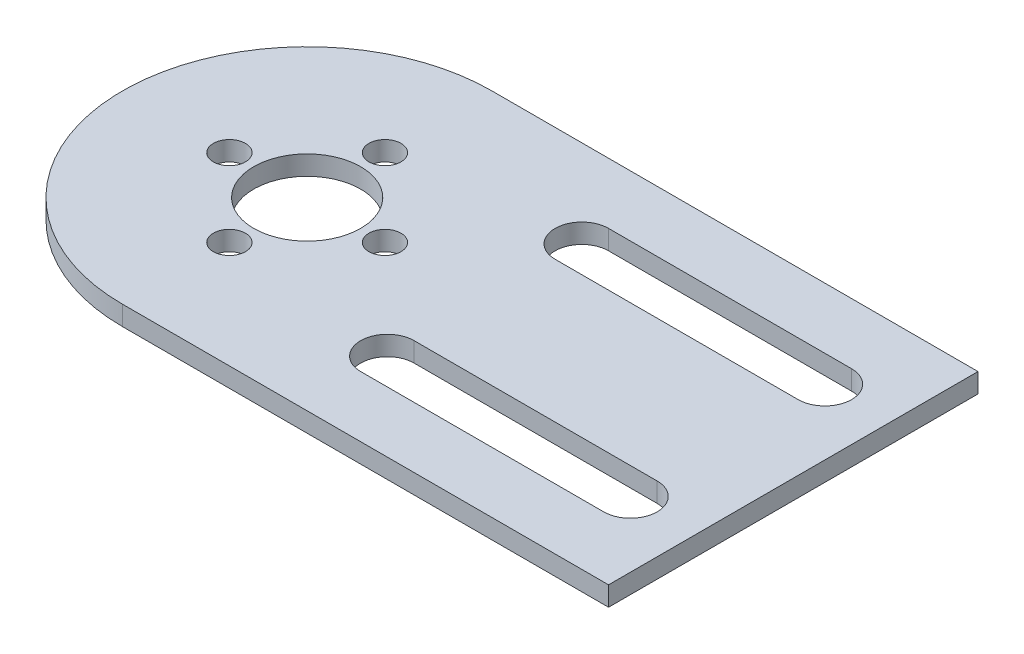
ISO-10303-21;
HEADER;
FILE_DESCRIPTION(('STEP AP214'),'2;1');
FILE_NAME('part.step','',(''),(''),'','','');
FILE_SCHEMA(('AUTOMOTIVE_DESIGN { 1 0 10303 214 1 1 1 1 }'));
ENDSEC;
DATA;
#1=APPLICATION_CONTEXT('core data for automotive mechanical design processes');
#2=APPLICATION_PROTOCOL_DEFINITION('international standard','automotive_design',2000,#1);
#3=PRODUCT_CONTEXT('',#1,'mechanical');
#4=PRODUCT('Part','Part','',(#3));
#5=PRODUCT_RELATED_PRODUCT_CATEGORY('part','',(#4));
#6=PRODUCT_DEFINITION_FORMATION('','',#4);
#7=PRODUCT_DEFINITION_CONTEXT('part definition',#1,'design');
#8=PRODUCT_DEFINITION('design','',#6,#7);
#9=PRODUCT_DEFINITION_SHAPE('','',#8);
#10=(LENGTH_UNIT() NAMED_UNIT(*) SI_UNIT(.MILLI.,.METRE.));
#11=(NAMED_UNIT(*) PLANE_ANGLE_UNIT() SI_UNIT($,.RADIAN.));
#12=(NAMED_UNIT(*) SI_UNIT($,.STERADIAN.) SOLID_ANGLE_UNIT());
#13=UNCERTAINTY_MEASURE_WITH_UNIT(LENGTH_MEASURE(1.E-05),#10,'distance_accuracy_value','');
#14=(GEOMETRIC_REPRESENTATION_CONTEXT(3) GLOBAL_UNCERTAINTY_ASSIGNED_CONTEXT((#13)) GLOBAL_UNIT_ASSIGNED_CONTEXT((#10,
#11,#12)) REPRESENTATION_CONTEXT('',''));
#15=CARTESIAN_POINT('',(0.,0.,0.));
#16=DIRECTION('',(0.,0.,1.));
#17=DIRECTION('',(1.,0.,0.));
#18=AXIS2_PLACEMENT_3D('',#15,#16,#17);
#19=CARTESIAN_POINT('',(0.,2.,0.));
#20=DIRECTION('',(0.,-1.,0.));
#21=DIRECTION('',(0.,0.,-1.));
#22=AXIS2_PLACEMENT_3D('',#19,#20,#21);
#23=CYLINDRICAL_SURFACE('',#22,19.);
#24=CARTESIAN_POINT('',(0.,0.,0.));
#25=DIRECTION('',(0.,1.,0.));
#26=DIRECTION('',(0.,0.,1.));
#27=AXIS2_PLACEMENT_3D('',#24,#25,#26);
#28=CIRCLE('',#27,19.);
#29=CARTESIAN_POINT('',(0.,0.,-19.));
#30=VERTEX_POINT('',#29);
#31=CARTESIAN_POINT('',(0.,0.,19.));
#32=VERTEX_POINT('',#31);
#33=EDGE_CURVE('E239',#30,#32,#28,.T.);
#34=ORIENTED_EDGE('',*,*,#33,.T.);
#35=DIRECTION('',(0.,-1.,0.));
#36=VECTOR('',#35,1.);
#37=CARTESIAN_POINT('',(0.,2.,19.));
#38=LINE('',#37,#36);
#39=CARTESIAN_POINT('',(0.,2.,19.));
#40=VERTEX_POINT('',#39);
#41=EDGE_CURVE('E11',#40,#32,#38,.T.);
#42=ORIENTED_EDGE('',*,*,#41,.F.);
#43=CARTESIAN_POINT('',(0.,2.,0.));
#44=DIRECTION('',(0.,1.,0.));
#45=DIRECTION('',(0.,0.,1.));
#46=AXIS2_PLACEMENT_3D('',#43,#44,#45);
#47=CIRCLE('',#46,19.);
#48=CARTESIAN_POINT('',(0.,2.,-19.));
#49=VERTEX_POINT('',#48);
#50=EDGE_CURVE('E243',#49,#40,#47,.T.);
#51=ORIENTED_EDGE('',*,*,#50,.F.);
#52=DIRECTION('',(0.,-1.,0.));
#53=VECTOR('',#52,1.);
#54=CARTESIAN_POINT('',(0.,2.,-19.));
#55=LINE('',#54,#53);
#56=EDGE_CURVE('E257',#49,#30,#55,.T.);
#57=ORIENTED_EDGE('',*,*,#56,.T.);
#58=EDGE_LOOP('',(#34,#42,#51,#57));
#59=FACE_BOUND('',#58,.T.);
#60=ADVANCED_FACE('F39',(#59),#23,.T.);
#61=CARTESIAN_POINT('',(50.,2.,19.));
#62=DIRECTION('',(0.,0.,-1.));
#63=DIRECTION('',(-1.,0.,0.));
#64=AXIS2_PLACEMENT_3D('',#61,#62,#63);
#65=PLANE('',#64);
#66=DIRECTION('',(1.,0.,0.));
#67=VECTOR('',#66,1.);
#68=CARTESIAN_POINT('',(50.,0.,19.));
#69=LINE('',#68,#67);
#70=CARTESIAN_POINT('',(50.,0.,19.));
#71=VERTEX_POINT('',#70);
#72=EDGE_CURVE('E261',#32,#71,#69,.T.);
#73=ORIENTED_EDGE('',*,*,#72,.T.);
#74=DIRECTION('',(0.,-1.,0.));
#75=VECTOR('',#74,1.);
#76=CARTESIAN_POINT('',(50.,2.,19.));
#77=LINE('',#76,#75);
#78=CARTESIAN_POINT('',(50.,2.,19.));
#79=VERTEX_POINT('',#78);
#80=EDGE_CURVE('E47',#79,#71,#77,.T.);
#81=ORIENTED_EDGE('',*,*,#80,.F.);
#82=DIRECTION('',(1.,0.,0.));
#83=VECTOR('',#82,1.);
#84=CARTESIAN_POINT('',(50.,2.,19.));
#85=LINE('',#84,#83);
#86=EDGE_CURVE('E247',#40,#79,#85,.T.);
#87=ORIENTED_EDGE('',*,*,#86,.F.);
#88=ORIENTED_EDGE('',*,*,#41,.T.);
#89=EDGE_LOOP('',(#73,#81,#87,#88));
#90=FACE_BOUND('',#89,.T.);
#91=ADVANCED_FACE('F296',(#90),#65,.F.);
#92=CARTESIAN_POINT('',(50.,2.,-19.));
#93=DIRECTION('',(-1.,0.,0.));
#94=DIRECTION('',(0.,0.,1.));
#95=AXIS2_PLACEMENT_3D('',#92,#93,#94);
#96=PLANE('',#95);
#97=DIRECTION('',(0.,0.,-1.));
#98=VECTOR('',#97,1.);
#99=CARTESIAN_POINT('',(50.,0.,-19.));
#100=LINE('',#99,#98);
#101=CARTESIAN_POINT('',(50.,0.,-19.));
#102=VERTEX_POINT('',#101);
#103=EDGE_CURVE('E264',#71,#102,#100,.T.);
#104=ORIENTED_EDGE('',*,*,#103,.T.);
#105=DIRECTION('',(0.,-1.,0.));
#106=VECTOR('',#105,1.);
#107=CARTESIAN_POINT('',(50.,2.,-19.));
#108=LINE('',#107,#106);
#109=CARTESIAN_POINT('',(50.,2.,-19.));
#110=VERTEX_POINT('',#109);
#111=EDGE_CURVE('E272',#110,#102,#108,.T.);
#112=ORIENTED_EDGE('',*,*,#111,.F.);
#113=DIRECTION('',(0.,0.,-1.));
#114=VECTOR('',#113,1.);
#115=CARTESIAN_POINT('',(50.,2.,-19.));
#116=LINE('',#115,#114);
#117=EDGE_CURVE('E251',#79,#110,#116,.T.);
#118=ORIENTED_EDGE('',*,*,#117,.F.);
#119=ORIENTED_EDGE('',*,*,#80,.T.);
#120=EDGE_LOOP('',(#104,#112,#118,#119));
#121=FACE_BOUND('',#120,.T.);
#122=ADVANCED_FACE('F281',(#121),#96,.F.);
#123=CARTESIAN_POINT('',(0.,2.,-19.));
#124=DIRECTION('',(0.,0.,1.));
#125=DIRECTION('',(1.,0.,0.));
#126=AXIS2_PLACEMENT_3D('',#123,#124,#125);
#127=PLANE('',#126);
#128=DIRECTION('',(-1.,0.,0.));
#129=VECTOR('',#128,1.);
#130=CARTESIAN_POINT('',(0.,0.,-19.));
#131=LINE('',#130,#129);
#132=EDGE_CURVE('E248',#102,#30,#131,.T.);
#133=ORIENTED_EDGE('',*,*,#132,.T.);
#134=ORIENTED_EDGE('',*,*,#56,.F.);
#135=DIRECTION('',(-1.,0.,0.));
#136=VECTOR('',#135,1.);
#137=CARTESIAN_POINT('',(0.,2.,-19.));
#138=LINE('',#137,#136);
#139=EDGE_CURVE('E254',#110,#49,#138,.T.);
#140=ORIENTED_EDGE('',*,*,#139,.F.);
#141=ORIENTED_EDGE('',*,*,#111,.T.);
#142=EDGE_LOOP('',(#133,#134,#140,#141));
#143=FACE_BOUND('',#142,.T.);
#144=ADVANCED_FACE('F289',(#143),#127,.F.);
#145=CARTESIAN_POINT('',(0.,2.,0.));
#146=DIRECTION('',(0.,1.,0.));
#147=DIRECTION('',(0.,0.,1.));
#148=AXIS2_PLACEMENT_3D('',#145,#146,#147);
#149=PLANE('',#148);
#150=CARTESIAN_POINT('',(43.25,2.,10.));
#151=DIRECTION('',(0.,1.,0.));
#152=DIRECTION('',(0.,0.,-1.));
#153=AXIS2_PLACEMENT_3D('',#150,#151,#152);
#154=CIRCLE('',#153,2.75);
#155=CARTESIAN_POINT('',(43.25,2.,12.75));
#156=VERTEX_POINT('',#155);
#157=CARTESIAN_POINT('',(43.25,2.,7.25));
#158=VERTEX_POINT('',#157);
#159=EDGE_CURVE('E54',#156,#158,#154,.T.);
#160=ORIENTED_EDGE('',*,*,#159,.F.);
#161=DIRECTION('',(1.,0.,0.));
#162=VECTOR('',#161,1.);
#163=CARTESIAN_POINT('',(18.25,2.,12.75));
#164=LINE('',#163,#162);
#165=CARTESIAN_POINT('',(18.25,2.,12.75));
#166=VERTEX_POINT('',#165);
#167=EDGE_CURVE('E152',#166,#156,#164,.T.);
#168=ORIENTED_EDGE('',*,*,#167,.F.);
#169=CARTESIAN_POINT('',(18.25,2.,10.));
#170=DIRECTION('',(0.,1.,0.));
#171=DIRECTION('',(0.,0.,-1.));
#172=AXIS2_PLACEMENT_3D('',#169,#170,#171);
#173=CIRCLE('',#172,2.75);
#174=CARTESIAN_POINT('',(18.25,2.,7.25));
#175=VERTEX_POINT('',#174);
#176=EDGE_CURVE('E156',#175,#166,#173,.T.);
#177=ORIENTED_EDGE('',*,*,#176,.F.);
#178=DIRECTION('',(-1.,0.,0.));
#179=VECTOR('',#178,1.);
#180=CARTESIAN_POINT('',(43.25,2.,7.25));
#181=LINE('',#180,#179);
#182=EDGE_CURVE('E168',#158,#175,#181,.T.);
#183=ORIENTED_EDGE('',*,*,#182,.F.);
#184=EDGE_LOOP('',(#160,#168,#177,#183));
#185=FACE_BOUND('',#184,.T.);
#186=CARTESIAN_POINT('',(-8.,2.,0.));
#187=DIRECTION('',(0.,1.,0.));
#188=DIRECTION('',(0.,0.,1.));
#189=AXIS2_PLACEMENT_3D('',#186,#187,#188);
#190=CIRCLE('',#189,1.65);
#191=CARTESIAN_POINT('',(-8.,2.,1.64999999999997));
#192=VERTEX_POINT('',#191);
#193=EDGE_CURVE('E159',#192,#192,#190,.T.);
#194=ORIENTED_EDGE('',*,*,#193,.F.);
#195=EDGE_LOOP('',(#194));
#196=FACE_BOUND('',#195,.T.);
#197=CARTESIAN_POINT('',(18.25,2.,-10.));
#198=DIRECTION('',(0.,1.,0.));
#199=DIRECTION('',(0.,0.,1.));
#200=AXIS2_PLACEMENT_3D('',#197,#198,#199);
#201=CIRCLE('',#200,2.75);
#202=CARTESIAN_POINT('',(18.25,2.,-12.75));
#203=VERTEX_POINT('',#202);
#204=CARTESIAN_POINT('',(18.25,2.,-7.25));
#205=VERTEX_POINT('',#204);
#206=EDGE_CURVE('E62',#203,#205,#201,.T.);
#207=ORIENTED_EDGE('',*,*,#206,.F.);
#208=DIRECTION('',(-1.,0.,0.));
#209=VECTOR('',#208,1.);
#210=CARTESIAN_POINT('',(18.25,2.,-12.75));
#211=LINE('',#210,#209);
#212=CARTESIAN_POINT('',(43.25,2.,-12.75));
#213=VERTEX_POINT('',#212);
#214=EDGE_CURVE('E198',#213,#203,#211,.T.);
#215=ORIENTED_EDGE('',*,*,#214,.F.);
#216=CARTESIAN_POINT('',(43.25,2.,-10.));
#217=DIRECTION('',(0.,1.,0.));
#218=DIRECTION('',(0.,0.,1.));
#219=AXIS2_PLACEMENT_3D('',#216,#217,#218);
#220=CIRCLE('',#219,2.75);
#221=CARTESIAN_POINT('',(43.25,2.,-7.25));
#222=VERTEX_POINT('',#221);
#223=EDGE_CURVE('E218',#222,#213,#220,.T.);
#224=ORIENTED_EDGE('',*,*,#223,.F.);
#225=DIRECTION('',(1.,0.,0.));
#226=VECTOR('',#225,1.);
#227=CARTESIAN_POINT('',(43.25,2.,-7.25));
#228=LINE('',#227,#226);
#229=EDGE_CURVE('E213',#205,#222,#228,.T.);
#230=ORIENTED_EDGE('',*,*,#229,.F.);
#231=EDGE_LOOP('',(#207,#215,#224,#230));
#232=FACE_BOUND('',#231,.T.);
#233=CARTESIAN_POINT('',(0.,2.,8.));
#234=DIRECTION('',(0.,1.,0.));
#235=DIRECTION('',(0.,0.,1.));
#236=AXIS2_PLACEMENT_3D('',#233,#234,#235);
#237=CIRCLE('',#236,1.65);
#238=CARTESIAN_POINT('',(0.,2.,9.65));
#239=VERTEX_POINT('',#238);
#240=EDGE_CURVE('E188',#239,#239,#237,.T.);
#241=ORIENTED_EDGE('',*,*,#240,.F.);
#242=EDGE_LOOP('',(#241));
#243=FACE_BOUND('',#242,.T.);
#244=CARTESIAN_POINT('',(0.,2.,-8.));
#245=DIRECTION('',(0.,1.,0.));
#246=DIRECTION('',(0.,0.,1.));
#247=AXIS2_PLACEMENT_3D('',#244,#245,#246);
#248=CIRCLE('',#247,1.65);
#249=CARTESIAN_POINT('',(0.,2.,-6.35));
#250=VERTEX_POINT('',#249);
#251=EDGE_CURVE('E364',#250,#250,#248,.T.);
#252=ORIENTED_EDGE('',*,*,#251,.F.);
#253=EDGE_LOOP('',(#252));
#254=FACE_BOUND('',#253,.T.);
#255=CARTESIAN_POINT('',(8.,2.,0.));
#256=DIRECTION('',(0.,1.,0.));
#257=DIRECTION('',(0.,0.,1.));
#258=AXIS2_PLACEMENT_3D('',#255,#256,#257);
#259=CIRCLE('',#258,1.65);
#260=CARTESIAN_POINT('',(8.,2.,1.65000000000009));
#261=VERTEX_POINT('',#260);
#262=EDGE_CURVE('E373',#261,#261,#259,.T.);
#263=ORIENTED_EDGE('',*,*,#262,.F.);
#264=EDGE_LOOP('',(#263));
#265=FACE_BOUND('',#264,.T.);
#266=CARTESIAN_POINT('',(0.,2.,0.));
#267=DIRECTION('',(0.,1.,0.));
#268=DIRECTION('',(0.,0.,1.));
#269=AXIS2_PLACEMENT_3D('',#266,#267,#268);
#270=CIRCLE('',#269,5.5);
#271=CARTESIAN_POINT('',(0.,2.,5.5));
#272=VERTEX_POINT('',#271);
#273=EDGE_CURVE('E187',#272,#272,#270,.T.);
#274=ORIENTED_EDGE('',*,*,#273,.F.);
#275=EDGE_LOOP('',(#274));
#276=FACE_BOUND('',#275,.T.);
#277=ORIENTED_EDGE('',*,*,#50,.T.);
#278=ORIENTED_EDGE('',*,*,#86,.T.);
#279=ORIENTED_EDGE('',*,*,#117,.T.);
#280=ORIENTED_EDGE('',*,*,#139,.T.);
#281=EDGE_LOOP('',(#277,#278,#279,#280));
#282=FACE_BOUND('',#281,.T.);
#283=ADVANCED_FACE('F295',(#185,#196,#232,#243,#254,#265,#276,#282),#149,.T.);
#284=CARTESIAN_POINT('',(0.,0.,0.));
#285=DIRECTION('',(0.,1.,0.));
#286=DIRECTION('',(0.,0.,1.));
#287=AXIS2_PLACEMENT_3D('',#284,#285,#286);
#288=PLANE('',#287);
#289=DIRECTION('',(1.,0.,0.));
#290=VECTOR('',#289,1.);
#291=CARTESIAN_POINT('',(18.25,0.,12.75));
#292=LINE('',#291,#290);
#293=CARTESIAN_POINT('',(18.25,0.,12.75));
#294=VERTEX_POINT('',#293);
#295=CARTESIAN_POINT('',(43.25,0.,12.75));
#296=VERTEX_POINT('',#295);
#297=EDGE_CURVE('E137',#294,#296,#292,.T.);
#298=ORIENTED_EDGE('',*,*,#297,.T.);
#299=CARTESIAN_POINT('',(43.25,0.,10.));
#300=DIRECTION('',(0.,1.,0.));
#301=DIRECTION('',(0.,0.,-1.));
#302=AXIS2_PLACEMENT_3D('',#299,#300,#301);
#303=CIRCLE('',#302,2.75);
#304=CARTESIAN_POINT('',(43.25,0.,7.25));
#305=VERTEX_POINT('',#304);
#306=EDGE_CURVE('E130',#296,#305,#303,.T.);
#307=ORIENTED_EDGE('',*,*,#306,.T.);
#308=DIRECTION('',(-1.,0.,0.));
#309=VECTOR('',#308,1.);
#310=CARTESIAN_POINT('',(43.25,0.,7.25));
#311=LINE('',#310,#309);
#312=CARTESIAN_POINT('',(18.25,0.,7.25));
#313=VERTEX_POINT('',#312);
#314=EDGE_CURVE('E141',#305,#313,#311,.T.);
#315=ORIENTED_EDGE('',*,*,#314,.T.);
#316=CARTESIAN_POINT('',(18.25,0.,10.));
#317=DIRECTION('',(0.,1.,0.));
#318=DIRECTION('',(0.,0.,-1.));
#319=AXIS2_PLACEMENT_3D('',#316,#317,#318);
#320=CIRCLE('',#319,2.75);
#321=EDGE_CURVE('E146',#313,#294,#320,.T.);
#322=ORIENTED_EDGE('',*,*,#321,.T.);
#323=EDGE_LOOP('',(#298,#307,#315,#322));
#324=FACE_BOUND('',#323,.T.);
#325=CARTESIAN_POINT('',(-8.,0.,0.));
#326=DIRECTION('',(0.,1.,0.));
#327=DIRECTION('',(0.,0.,1.));
#328=AXIS2_PLACEMENT_3D('',#325,#326,#327);
#329=CIRCLE('',#328,1.65);
#330=CARTESIAN_POINT('',(-8.,0.,1.64999999999997));
#331=VERTEX_POINT('',#330);
#332=EDGE_CURVE('E214',#331,#331,#329,.T.);
#333=ORIENTED_EDGE('',*,*,#332,.T.);
#334=EDGE_LOOP('',(#333));
#335=FACE_BOUND('',#334,.T.);
#336=DIRECTION('',(-1.,0.,0.));
#337=VECTOR('',#336,1.);
#338=CARTESIAN_POINT('',(18.25,0.,-12.75));
#339=LINE('',#338,#337);
#340=CARTESIAN_POINT('',(43.25,0.,-12.75));
#341=VERTEX_POINT('',#340);
#342=CARTESIAN_POINT('',(18.25,0.,-12.75));
#343=VERTEX_POINT('',#342);
#344=EDGE_CURVE('E206',#341,#343,#339,.T.);
#345=ORIENTED_EDGE('',*,*,#344,.T.);
#346=CARTESIAN_POINT('',(18.25,0.,-10.));
#347=DIRECTION('',(0.,1.,0.));
#348=DIRECTION('',(0.,0.,1.));
#349=AXIS2_PLACEMENT_3D('',#346,#347,#348);
#350=CIRCLE('',#349,2.75);
#351=CARTESIAN_POINT('',(18.25,0.,-7.25));
#352=VERTEX_POINT('',#351);
#353=EDGE_CURVE('E193',#343,#352,#350,.T.);
#354=ORIENTED_EDGE('',*,*,#353,.T.);
#355=DIRECTION('',(1.,0.,0.));
#356=VECTOR('',#355,1.);
#357=CARTESIAN_POINT('',(43.25,0.,-7.25));
#358=LINE('',#357,#356);
#359=CARTESIAN_POINT('',(43.25,0.,-7.25));
#360=VERTEX_POINT('',#359);
#361=EDGE_CURVE('E197',#352,#360,#358,.T.);
#362=ORIENTED_EDGE('',*,*,#361,.T.);
#363=CARTESIAN_POINT('',(43.25,0.,-10.));
#364=DIRECTION('',(0.,1.,0.));
#365=DIRECTION('',(0.,0.,1.));
#366=AXIS2_PLACEMENT_3D('',#363,#364,#365);
#367=CIRCLE('',#366,2.75);
#368=EDGE_CURVE('E202',#360,#341,#367,.T.);
#369=ORIENTED_EDGE('',*,*,#368,.T.);
#370=EDGE_LOOP('',(#345,#354,#362,#369));
#371=FACE_BOUND('',#370,.T.);
#372=CARTESIAN_POINT('',(0.,0.,8.));
#373=DIRECTION('',(0.,1.,0.));
#374=DIRECTION('',(0.,0.,1.));
#375=AXIS2_PLACEMENT_3D('',#372,#373,#374);
#376=CIRCLE('',#375,1.65);
#377=CARTESIAN_POINT('',(0.,0.,9.65));
#378=VERTEX_POINT('',#377);
#379=EDGE_CURVE('E183',#378,#378,#376,.T.);
#380=ORIENTED_EDGE('',*,*,#379,.T.);
#381=EDGE_LOOP('',(#380));
#382=FACE_BOUND('',#381,.T.);
#383=CARTESIAN_POINT('',(0.,0.,-8.));
#384=DIRECTION('',(0.,1.,0.));
#385=DIRECTION('',(0.,0.,1.));
#386=AXIS2_PLACEMENT_3D('',#383,#384,#385);
#387=CIRCLE('',#386,1.65);
#388=CARTESIAN_POINT('',(0.,0.,-6.35));
#389=VERTEX_POINT('',#388);
#390=EDGE_CURVE('E169',#389,#389,#387,.T.);
#391=ORIENTED_EDGE('',*,*,#390,.T.);
#392=EDGE_LOOP('',(#391));
#393=FACE_BOUND('',#392,.T.);
#394=CARTESIAN_POINT('',(8.,0.,0.));
#395=DIRECTION('',(0.,1.,0.));
#396=DIRECTION('',(0.,0.,1.));
#397=AXIS2_PLACEMENT_3D('',#394,#395,#396);
#398=CIRCLE('',#397,1.65);
#399=CARTESIAN_POINT('',(8.,0.,1.65000000000009));
#400=VERTEX_POINT('',#399);
#401=EDGE_CURVE('E367',#400,#400,#398,.T.);
#402=ORIENTED_EDGE('',*,*,#401,.T.);
#403=EDGE_LOOP('',(#402));
#404=FACE_BOUND('',#403,.T.);
#405=CARTESIAN_POINT('',(0.,0.,0.));
#406=DIRECTION('',(0.,1.,0.));
#407=DIRECTION('',(0.,0.,1.));
#408=AXIS2_PLACEMENT_3D('',#405,#406,#407);
#409=CIRCLE('',#408,5.5);
#410=CARTESIAN_POINT('',(0.,0.,5.5));
#411=VERTEX_POINT('',#410);
#412=EDGE_CURVE('E235',#411,#411,#409,.T.);
#413=ORIENTED_EDGE('',*,*,#412,.T.);
#414=EDGE_LOOP('',(#413));
#415=FACE_BOUND('',#414,.T.);
#416=ORIENTED_EDGE('',*,*,#33,.F.);
#417=ORIENTED_EDGE('',*,*,#132,.F.);
#418=ORIENTED_EDGE('',*,*,#103,.F.);
#419=ORIENTED_EDGE('',*,*,#72,.F.);
#420=EDGE_LOOP('',(#416,#417,#418,#419));
#421=FACE_BOUND('',#420,.T.);
#422=ADVANCED_FACE('F148',(#324,#335,#371,#382,#393,#404,#415,#421),#288,.F.);
#423=CARTESIAN_POINT('',(0.,0.,0.));
#424=DIRECTION('',(0.,1.,0.));
#425=DIRECTION('',(0.,0.,1.));
#426=AXIS2_PLACEMENT_3D('',#423,#424,#425);
#427=CYLINDRICAL_SURFACE('',#426,5.5);
#428=ORIENTED_EDGE('',*,*,#412,.F.);
#429=EDGE_LOOP('',(#428));
#430=FACE_BOUND('',#429,.T.);
#431=ORIENTED_EDGE('',*,*,#273,.T.);
#432=EDGE_LOOP('',(#431));
#433=FACE_BOUND('',#432,.T.);
#434=ADVANCED_FACE('F308',(#430,#433),#427,.F.);
#435=CARTESIAN_POINT('',(8.,0.,0.));
#436=DIRECTION('',(0.,1.,0.));
#437=DIRECTION('',(0.,0.,1.));
#438=AXIS2_PLACEMENT_3D('',#435,#436,#437);
#439=CYLINDRICAL_SURFACE('',#438,1.65);
#440=ORIENTED_EDGE('',*,*,#401,.F.);
#441=EDGE_LOOP('',(#440));
#442=FACE_BOUND('',#441,.T.);
#443=ORIENTED_EDGE('',*,*,#262,.T.);
#444=EDGE_LOOP('',(#443));
#445=FACE_BOUND('',#444,.T.);
#446=ADVANCED_FACE('F314',(#442,#445),#439,.F.);
#447=CARTESIAN_POINT('',(0.,0.,-8.));
#448=DIRECTION('',(0.,1.,0.));
#449=DIRECTION('',(0.,0.,1.));
#450=AXIS2_PLACEMENT_3D('',#447,#448,#449);
#451=CYLINDRICAL_SURFACE('',#450,1.65);
#452=ORIENTED_EDGE('',*,*,#390,.F.);
#453=EDGE_LOOP('',(#452));
#454=FACE_BOUND('',#453,.T.);
#455=ORIENTED_EDGE('',*,*,#251,.T.);
#456=EDGE_LOOP('',(#455));
#457=FACE_BOUND('',#456,.T.);
#458=ADVANCED_FACE('F335',(#454,#457),#451,.F.);
#459=CARTESIAN_POINT('',(0.,0.,8.));
#460=DIRECTION('',(0.,1.,0.));
#461=DIRECTION('',(0.,0.,1.));
#462=AXIS2_PLACEMENT_3D('',#459,#460,#461);
#463=CYLINDRICAL_SURFACE('',#462,1.65);
#464=ORIENTED_EDGE('',*,*,#379,.F.);
#465=EDGE_LOOP('',(#464));
#466=FACE_BOUND('',#465,.T.);
#467=ORIENTED_EDGE('',*,*,#240,.T.);
#468=EDGE_LOOP('',(#467));
#469=FACE_BOUND('',#468,.T.);
#470=ADVANCED_FACE('F320',(#466,#469),#463,.F.);
#471=CARTESIAN_POINT('',(18.25,0.,-10.));
#472=DIRECTION('',(0.,1.,0.));
#473=DIRECTION('',(0.,0.,1.));
#474=AXIS2_PLACEMENT_3D('',#471,#472,#473);
#475=CYLINDRICAL_SURFACE('',#474,2.75);
#476=ORIENTED_EDGE('',*,*,#206,.T.);
#477=DIRECTION('',(0.,1.,0.));
#478=VECTOR('',#477,1.);
#479=CARTESIAN_POINT('',(18.25,0.,-7.25));
#480=LINE('',#479,#478);
#481=EDGE_CURVE('E210',#352,#205,#480,.T.);
#482=ORIENTED_EDGE('',*,*,#481,.F.);
#483=ORIENTED_EDGE('',*,*,#353,.F.);
#484=DIRECTION('',(0.,1.,0.));
#485=VECTOR('',#484,1.);
#486=CARTESIAN_POINT('',(18.25,0.,-12.75));
#487=LINE('',#486,#485);
#488=EDGE_CURVE('E192',#343,#203,#487,.T.);
#489=ORIENTED_EDGE('',*,*,#488,.T.);
#490=EDGE_LOOP('',(#476,#482,#483,#489));
#491=FACE_BOUND('',#490,.T.);
#492=ADVANCED_FACE('F316',(#491),#475,.F.);
#493=CARTESIAN_POINT('',(18.25,0.,-12.75));
#494=DIRECTION('',(0.,0.,-1.));
#495=DIRECTION('',(-1.,0.,0.));
#496=AXIS2_PLACEMENT_3D('',#493,#494,#495);
#497=PLANE('',#496);
#498=ORIENTED_EDGE('',*,*,#214,.T.);
#499=ORIENTED_EDGE('',*,*,#488,.F.);
#500=ORIENTED_EDGE('',*,*,#344,.F.);
#501=DIRECTION('',(0.,1.,0.));
#502=VECTOR('',#501,1.);
#503=CARTESIAN_POINT('',(43.25,0.,-12.75));
#504=LINE('',#503,#502);
#505=EDGE_CURVE('E227',#341,#213,#504,.T.);
#506=ORIENTED_EDGE('',*,*,#505,.T.);
#507=EDGE_LOOP('',(#498,#499,#500,#506));
#508=FACE_BOUND('',#507,.T.);
#509=ADVANCED_FACE('F319',(#508),#497,.F.);
#510=CARTESIAN_POINT('',(43.25,0.,-10.));
#511=DIRECTION('',(0.,1.,0.));
#512=DIRECTION('',(0.,0.,1.));
#513=AXIS2_PLACEMENT_3D('',#510,#511,#512);
#514=CYLINDRICAL_SURFACE('',#513,2.75);
#515=ORIENTED_EDGE('',*,*,#223,.T.);
#516=ORIENTED_EDGE('',*,*,#505,.F.);
#517=ORIENTED_EDGE('',*,*,#368,.F.);
#518=DIRECTION('',(0.,1.,0.));
#519=VECTOR('',#518,1.);
#520=CARTESIAN_POINT('',(43.25,0.,-7.25));
#521=LINE('',#520,#519);
#522=EDGE_CURVE('E230',#360,#222,#521,.T.);
#523=ORIENTED_EDGE('',*,*,#522,.T.);
#524=EDGE_LOOP('',(#515,#516,#517,#523));
#525=FACE_BOUND('',#524,.T.);
#526=ADVANCED_FACE('F325',(#525),#514,.F.);
#527=CARTESIAN_POINT('',(43.25,0.,-7.25));
#528=DIRECTION('',(0.,0.,1.));
#529=DIRECTION('',(1.,0.,0.));
#530=AXIS2_PLACEMENT_3D('',#527,#528,#529);
#531=PLANE('',#530);
#532=ORIENTED_EDGE('',*,*,#229,.T.);
#533=ORIENTED_EDGE('',*,*,#522,.F.);
#534=ORIENTED_EDGE('',*,*,#361,.F.);
#535=ORIENTED_EDGE('',*,*,#481,.T.);
#536=EDGE_LOOP('',(#532,#533,#534,#535));
#537=FACE_BOUND('',#536,.T.);
#538=ADVANCED_FACE('F321',(#537),#531,.F.);
#539=CARTESIAN_POINT('',(-8.,0.,0.));
#540=DIRECTION('',(0.,1.,0.));
#541=DIRECTION('',(0.,0.,1.));
#542=AXIS2_PLACEMENT_3D('',#539,#540,#541);
#543=CYLINDRICAL_SURFACE('',#542,1.65);
#544=ORIENTED_EDGE('',*,*,#332,.F.);
#545=EDGE_LOOP('',(#544));
#546=FACE_BOUND('',#545,.T.);
#547=ORIENTED_EDGE('',*,*,#193,.T.);
#548=EDGE_LOOP('',(#547));
#549=FACE_BOUND('',#548,.T.);
#550=ADVANCED_FACE('F324',(#546,#549),#543,.F.);
#551=CARTESIAN_POINT('',(43.25,0.,10.));
#552=DIRECTION('',(0.,1.,0.));
#553=DIRECTION('',(0.,0.,1.));
#554=AXIS2_PLACEMENT_3D('',#551,#552,#553);
#555=CYLINDRICAL_SURFACE('',#554,2.75);
#556=ORIENTED_EDGE('',*,*,#159,.T.);
#557=DIRECTION('',(0.,1.,0.));
#558=VECTOR('',#557,1.);
#559=CARTESIAN_POINT('',(43.25,0.,7.25));
#560=LINE('',#559,#558);
#561=EDGE_CURVE('E126',#305,#158,#560,.T.);
#562=ORIENTED_EDGE('',*,*,#561,.F.);
#563=ORIENTED_EDGE('',*,*,#306,.F.);
#564=DIRECTION('',(0.,1.,0.));
#565=VECTOR('',#564,1.);
#566=CARTESIAN_POINT('',(43.25,0.,12.75));
#567=LINE('',#566,#565);
#568=EDGE_CURVE('E175',#296,#156,#567,.T.);
#569=ORIENTED_EDGE('',*,*,#568,.T.);
#570=EDGE_LOOP('',(#556,#562,#563,#569));
#571=FACE_BOUND('',#570,.T.);
#572=ADVANCED_FACE('F128',(#571),#555,.F.);
#573=CARTESIAN_POINT('',(18.25,0.,12.75));
#574=DIRECTION('',(0.,0.,1.));
#575=DIRECTION('',(1.,0.,0.));
#576=AXIS2_PLACEMENT_3D('',#573,#574,#575);
#577=PLANE('',#576);
#578=ORIENTED_EDGE('',*,*,#167,.T.);
#579=ORIENTED_EDGE('',*,*,#568,.F.);
#580=ORIENTED_EDGE('',*,*,#297,.F.);
#581=DIRECTION('',(0.,1.,0.));
#582=VECTOR('',#581,1.);
#583=CARTESIAN_POINT('',(18.25,0.,12.75));
#584=LINE('',#583,#582);
#585=EDGE_CURVE('E178',#294,#166,#584,.T.);
#586=ORIENTED_EDGE('',*,*,#585,.T.);
#587=EDGE_LOOP('',(#578,#579,#580,#586));
#588=FACE_BOUND('',#587,.T.);
#589=ADVANCED_FACE('F339',(#588),#577,.F.);
#590=CARTESIAN_POINT('',(18.25,0.,10.));
#591=DIRECTION('',(0.,1.,0.));
#592=DIRECTION('',(0.,0.,1.));
#593=AXIS2_PLACEMENT_3D('',#590,#591,#592);
#594=CYLINDRICAL_SURFACE('',#593,2.75);
#595=ORIENTED_EDGE('',*,*,#176,.T.);
#596=ORIENTED_EDGE('',*,*,#585,.F.);
#597=ORIENTED_EDGE('',*,*,#321,.F.);
#598=DIRECTION('',(0.,1.,0.));
#599=VECTOR('',#598,1.);
#600=CARTESIAN_POINT('',(18.25,0.,7.25));
#601=LINE('',#600,#599);
#602=EDGE_CURVE('E136',#313,#175,#601,.T.);
#603=ORIENTED_EDGE('',*,*,#602,.T.);
#604=EDGE_LOOP('',(#595,#596,#597,#603));
#605=FACE_BOUND('',#604,.T.);
#606=ADVANCED_FACE('F342',(#605),#594,.F.);
#607=CARTESIAN_POINT('',(43.25,0.,7.25));
#608=DIRECTION('',(0.,0.,-1.));
#609=DIRECTION('',(-1.,0.,0.));
#610=AXIS2_PLACEMENT_3D('',#607,#608,#609);
#611=PLANE('',#610);
#612=ORIENTED_EDGE('',*,*,#182,.T.);
#613=ORIENTED_EDGE('',*,*,#602,.F.);
#614=ORIENTED_EDGE('',*,*,#314,.F.);
#615=ORIENTED_EDGE('',*,*,#561,.T.);
#616=EDGE_LOOP('',(#612,#613,#614,#615));
#617=FACE_BOUND('',#616,.T.);
#618=ADVANCED_FACE('F142',(#617),#611,.F.);
#619=CLOSED_SHELL('',(#60,#91,#122,#144,#283,#422,#434,#446,#458,#470,#492,#509,#526,#538,#550,
#572,#589,#606,#618));
#620=MANIFOLD_SOLID_BREP('B2',#619);
#621=ADVANCED_BREP_SHAPE_REPRESENTATION('',(#18,#620),#14);
#622=SHAPE_DEFINITION_REPRESENTATION(#9,#621);
ENDSEC;
END-ISO-10303-21;
